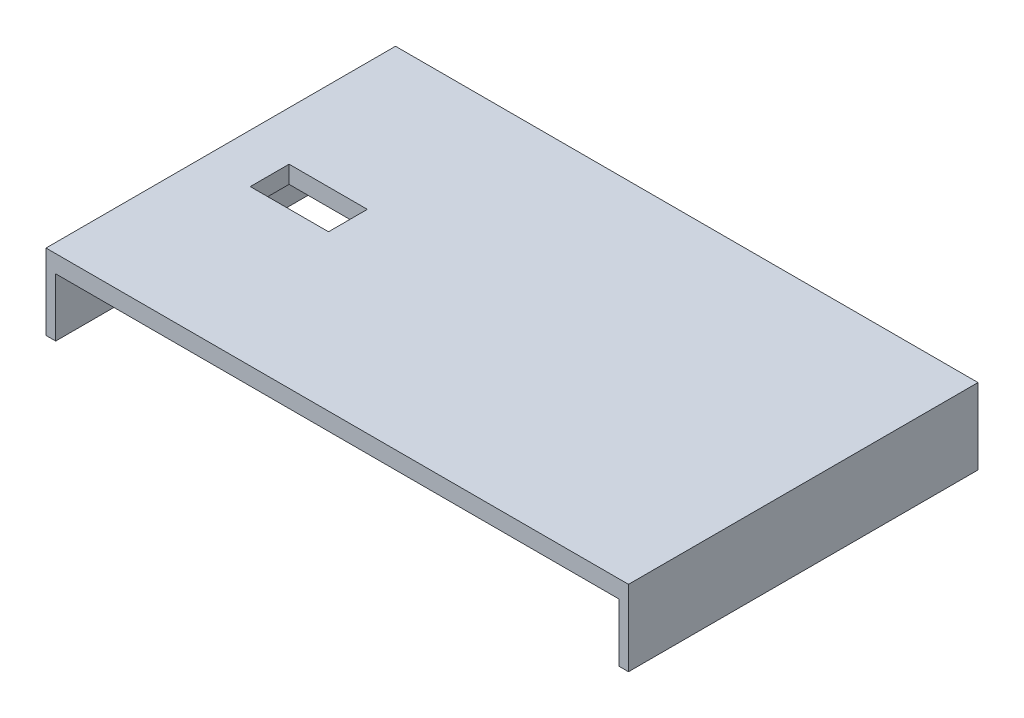
ISO-10303-21;
HEADER;
FILE_DESCRIPTION(('STEP AP214'),'2;1');
FILE_NAME('part.step','',(''),(''),'','','');
FILE_SCHEMA(('AUTOMOTIVE_DESIGN { 1 0 10303 214 1 1 1 1 }'));
ENDSEC;
DATA;
#1=APPLICATION_CONTEXT('core data for automotive mechanical design processes');
#2=APPLICATION_PROTOCOL_DEFINITION('international standard','automotive_design',2000,#1);
#3=PRODUCT_CONTEXT('',#1,'mechanical');
#4=PRODUCT('Part','Part','',(#3));
#5=PRODUCT_RELATED_PRODUCT_CATEGORY('part','',(#4));
#6=PRODUCT_DEFINITION_FORMATION('','',#4);
#7=PRODUCT_DEFINITION_CONTEXT('part definition',#1,'design');
#8=PRODUCT_DEFINITION('design','',#6,#7);
#9=PRODUCT_DEFINITION_SHAPE('','',#8);
#10=(LENGTH_UNIT() NAMED_UNIT(*) SI_UNIT(.MILLI.,.METRE.));
#11=(NAMED_UNIT(*) PLANE_ANGLE_UNIT() SI_UNIT($,.RADIAN.));
#12=(NAMED_UNIT(*) SI_UNIT($,.STERADIAN.) SOLID_ANGLE_UNIT());
#13=UNCERTAINTY_MEASURE_WITH_UNIT(LENGTH_MEASURE(1.E-05),#10,'distance_accuracy_value','');
#14=(GEOMETRIC_REPRESENTATION_CONTEXT(3) GLOBAL_UNCERTAINTY_ASSIGNED_CONTEXT((#13)) GLOBAL_UNIT_ASSIGNED_CONTEXT((#10,
#11,#12)) REPRESENTATION_CONTEXT('',''));
#15=CARTESIAN_POINT('',(0.,0.,0.));
#16=DIRECTION('',(0.,0.,1.));
#17=DIRECTION('',(1.,0.,0.));
#18=AXIS2_PLACEMENT_3D('',#15,#16,#17);
#19=CARTESIAN_POINT('',(0.,0.,0.));
#20=DIRECTION('',(0.,-1.,0.));
#21=DIRECTION('',(0.,0.,-1.));
#22=AXIS2_PLACEMENT_3D('',#19,#20,#21);
#23=PLANE('',#22);
#24=DIRECTION('',(-1.,0.,0.));
#25=VECTOR('',#24,1.);
#26=CARTESIAN_POINT('',(0.,0.,-180.));
#27=LINE('',#26,#25);
#28=CARTESIAN_POINT('',(295.,0.,-180.));
#29=VERTEX_POINT('',#28);
#30=CARTESIAN_POINT('',(5.,0.,-180.));
#31=VERTEX_POINT('',#30);
#32=EDGE_CURVE('E196',#29,#31,#27,.T.);
#33=ORIENTED_EDGE('',*,*,#32,.F.);
#34=DIRECTION('',(0.,0.,-1.));
#35=VECTOR('',#34,1.);
#36=CARTESIAN_POINT('',(295.,0.,0.));
#37=LINE('',#36,#35);
#38=CARTESIAN_POINT('',(295.,0.,0.));
#39=VERTEX_POINT('',#38);
#40=EDGE_CURVE('E137',#39,#29,#37,.T.);
#41=ORIENTED_EDGE('',*,*,#40,.F.);
#42=DIRECTION('',(1.,0.,0.));
#43=VECTOR('',#42,1.);
#44=CARTESIAN_POINT('',(0.,0.,0.));
#45=LINE('',#44,#43);
#46=CARTESIAN_POINT('',(5.,0.,0.));
#47=VERTEX_POINT('',#46);
#48=EDGE_CURVE('E191',#47,#39,#45,.T.);
#49=ORIENTED_EDGE('',*,*,#48,.F.);
#50=DIRECTION('',(0.,0.,1.));
#51=VECTOR('',#50,1.);
#52=CARTESIAN_POINT('',(5.,0.,-180.));
#53=LINE('',#52,#51);
#54=EDGE_CURVE('E172',#31,#47,#53,.T.);
#55=ORIENTED_EDGE('',*,*,#54,.F.);
#56=EDGE_LOOP('',(#33,#41,#49,#55));
#57=FACE_BOUND('',#56,.T.);
#58=DIRECTION('',(0.,0.,-1.));
#59=VECTOR('',#58,1.);
#60=CARTESIAN_POINT('',(65.5,0.,-80.));
#61=LINE('',#60,#59);
#62=CARTESIAN_POINT('',(65.5,0.,-80.));
#63=VERTEX_POINT('',#62);
#64=CARTESIAN_POINT('',(65.5,0.,-100.));
#65=VERTEX_POINT('',#64);
#66=EDGE_CURVE('E129',#63,#65,#61,.T.);
#67=ORIENTED_EDGE('',*,*,#66,.T.);
#68=DIRECTION('',(1.,0.,0.));
#69=VECTOR('',#68,1.);
#70=CARTESIAN_POINT('',(25.2,0.,-100.));
#71=LINE('',#70,#69);
#72=CARTESIAN_POINT('',(25.2,0.,-100.));
#73=VERTEX_POINT('',#72);
#74=EDGE_CURVE('E120',#73,#65,#71,.T.);
#75=ORIENTED_EDGE('',*,*,#74,.F.);
#76=DIRECTION('',(0.,0.,-1.));
#77=VECTOR('',#76,1.);
#78=CARTESIAN_POINT('',(25.2,0.,-80.));
#79=LINE('',#78,#77);
#80=CARTESIAN_POINT('',(25.2,0.,-80.));
#81=VERTEX_POINT('',#80);
#82=EDGE_CURVE('E141',#81,#73,#79,.T.);
#83=ORIENTED_EDGE('',*,*,#82,.F.);
#84=DIRECTION('',(1.,0.,0.));
#85=VECTOR('',#84,1.);
#86=CARTESIAN_POINT('',(25.2,0.,-80.));
#87=LINE('',#86,#85);
#88=EDGE_CURVE('E48',#81,#63,#87,.T.);
#89=ORIENTED_EDGE('',*,*,#88,.T.);
#90=EDGE_LOOP('',(#67,#75,#83,#89));
#91=FACE_BOUND('',#90,.T.);
#92=ADVANCED_FACE('F33',(#57,#91),#23,.T.);
#93=CARTESIAN_POINT('',(0.,9.,0.));
#94=DIRECTION('',(0.,-1.,0.));
#95=DIRECTION('',(0.,0.,-1.));
#96=AXIS2_PLACEMENT_3D('',#93,#94,#95);
#97=PLANE('',#96);
#98=DIRECTION('',(0.,0.,1.));
#99=VECTOR('',#98,1.);
#100=CARTESIAN_POINT('',(0.,9.,0.));
#101=LINE('',#100,#99);
#102=CARTESIAN_POINT('',(0.,9.,-180.));
#103=VERTEX_POINT('',#102);
#104=CARTESIAN_POINT('',(0.,9.,0.));
#105=VERTEX_POINT('',#104);
#106=EDGE_CURVE('E192',#103,#105,#101,.T.);
#107=ORIENTED_EDGE('',*,*,#106,.T.);
#108=DIRECTION('',(1.,0.,0.));
#109=VECTOR('',#108,1.);
#110=CARTESIAN_POINT('',(0.,9.,0.));
#111=LINE('',#110,#109);
#112=CARTESIAN_POINT('',(300.,9.,0.));
#113=VERTEX_POINT('',#112);
#114=EDGE_CURVE('E195',#105,#113,#111,.T.);
#115=ORIENTED_EDGE('',*,*,#114,.T.);
#116=DIRECTION('',(0.,0.,-1.));
#117=VECTOR('',#116,1.);
#118=CARTESIAN_POINT('',(300.,9.,0.));
#119=LINE('',#118,#117);
#120=CARTESIAN_POINT('',(300.,9.,-180.));
#121=VERTEX_POINT('',#120);
#122=EDGE_CURVE('E198',#113,#121,#119,.T.);
#123=ORIENTED_EDGE('',*,*,#122,.T.);
#124=DIRECTION('',(-1.,0.,0.));
#125=VECTOR('',#124,1.);
#126=CARTESIAN_POINT('',(0.,9.,-180.));
#127=LINE('',#126,#125);
#128=EDGE_CURVE('E200',#121,#103,#127,.T.);
#129=ORIENTED_EDGE('',*,*,#128,.T.);
#130=EDGE_LOOP('',(#107,#115,#123,#129));
#131=FACE_BOUND('',#130,.T.);
#132=DIRECTION('',(1.,0.,0.));
#133=VECTOR('',#132,1.);
#134=CARTESIAN_POINT('',(25.2,9.,-100.));
#135=LINE('',#134,#133);
#136=CARTESIAN_POINT('',(25.2,9.,-100.));
#137=VERTEX_POINT('',#136);
#138=CARTESIAN_POINT('',(65.5,9.,-100.));
#139=VERTEX_POINT('',#138);
#140=EDGE_CURVE('E56',#137,#139,#135,.T.);
#141=ORIENTED_EDGE('',*,*,#140,.T.);
#142=DIRECTION('',(0.,0.,-1.));
#143=VECTOR('',#142,1.);
#144=CARTESIAN_POINT('',(65.5,9.,-80.));
#145=LINE('',#144,#143);
#146=CARTESIAN_POINT('',(65.5,9.,-80.));
#147=VERTEX_POINT('',#146);
#148=EDGE_CURVE('E136',#147,#139,#145,.T.);
#149=ORIENTED_EDGE('',*,*,#148,.F.);
#150=DIRECTION('',(1.,0.,0.));
#151=VECTOR('',#150,1.);
#152=CARTESIAN_POINT('',(25.2,9.,-80.));
#153=LINE('',#152,#151);
#154=CARTESIAN_POINT('',(25.2,9.,-80.));
#155=VERTEX_POINT('',#154);
#156=EDGE_CURVE('E147',#155,#147,#153,.T.);
#157=ORIENTED_EDGE('',*,*,#156,.F.);
#158=DIRECTION('',(0.,0.,-1.));
#159=VECTOR('',#158,1.);
#160=CARTESIAN_POINT('',(25.2,9.,-80.));
#161=LINE('',#160,#159);
#162=EDGE_CURVE('E130',#155,#137,#161,.T.);
#163=ORIENTED_EDGE('',*,*,#162,.T.);
#164=EDGE_LOOP('',(#141,#149,#157,#163));
#165=FACE_BOUND('',#164,.T.);
#166=ADVANCED_FACE('F230',(#131,#165),#97,.F.);
#167=CARTESIAN_POINT('',(0.,9.,0.));
#168=DIRECTION('',(1.,0.,0.));
#169=DIRECTION('',(0.,0.,-1.));
#170=AXIS2_PLACEMENT_3D('',#167,#168,#169);
#171=PLANE('',#170);
#172=DIRECTION('',(0.,-1.,0.));
#173=VECTOR('',#172,1.);
#174=CARTESIAN_POINT('',(0.,9.,-180.));
#175=LINE('',#174,#173);
#176=CARTESIAN_POINT('',(0.,-30.,-180.));
#177=VERTEX_POINT('',#176);
#178=EDGE_CURVE('E202',#103,#177,#175,.T.);
#179=ORIENTED_EDGE('',*,*,#178,.T.);
#180=DIRECTION('',(0.,0.,-1.));
#181=VECTOR('',#180,1.);
#182=CARTESIAN_POINT('',(0.,-30.,-180.));
#183=LINE('',#182,#181);
#184=CARTESIAN_POINT('',(0.,-30.,0.));
#185=VERTEX_POINT('',#184);
#186=EDGE_CURVE('E173',#185,#177,#183,.T.);
#187=ORIENTED_EDGE('',*,*,#186,.F.);
#188=DIRECTION('',(0.,-1.,0.));
#189=VECTOR('',#188,1.);
#190=CARTESIAN_POINT('',(0.,9.,0.));
#191=LINE('',#190,#189);
#192=EDGE_CURVE('E11',#105,#185,#191,.T.);
#193=ORIENTED_EDGE('',*,*,#192,.F.);
#194=ORIENTED_EDGE('',*,*,#106,.F.);
#195=EDGE_LOOP('',(#179,#187,#193,#194));
#196=FACE_BOUND('',#195,.T.);
#197=ADVANCED_FACE('F35',(#196),#171,.F.);
#198=CARTESIAN_POINT('',(0.,9.,0.));
#199=DIRECTION('',(0.,0.,-1.));
#200=DIRECTION('',(-1.,0.,0.));
#201=AXIS2_PLACEMENT_3D('',#198,#199,#200);
#202=PLANE('',#201);
#203=ORIENTED_EDGE('',*,*,#192,.T.);
#204=DIRECTION('',(-1.,0.,0.));
#205=VECTOR('',#204,1.);
#206=CARTESIAN_POINT('',(0.,-30.,0.));
#207=LINE('',#206,#205);
#208=CARTESIAN_POINT('',(5.,-30.,0.));
#209=VERTEX_POINT('',#208);
#210=EDGE_CURVE('E180',#209,#185,#207,.T.);
#211=ORIENTED_EDGE('',*,*,#210,.F.);
#212=DIRECTION('',(0.,1.,0.));
#213=VECTOR('',#212,1.);
#214=CARTESIAN_POINT('',(5.,-30.,0.));
#215=LINE('',#214,#213);
#216=EDGE_CURVE('E183',#209,#47,#215,.T.);
#217=ORIENTED_EDGE('',*,*,#216,.T.);
#218=ORIENTED_EDGE('',*,*,#48,.T.);
#219=DIRECTION('',(0.,1.,0.));
#220=VECTOR('',#219,1.);
#221=CARTESIAN_POINT('',(295.,-30.,0.));
#222=LINE('',#221,#220);
#223=CARTESIAN_POINT('',(295.,-30.,0.));
#224=VERTEX_POINT('',#223);
#225=EDGE_CURVE('E170',#224,#39,#222,.T.);
#226=ORIENTED_EDGE('',*,*,#225,.F.);
#227=DIRECTION('',(-1.,0.,0.));
#228=VECTOR('',#227,1.);
#229=CARTESIAN_POINT('',(300.,-30.,0.));
#230=LINE('',#229,#228);
#231=CARTESIAN_POINT('',(300.,-30.,0.));
#232=VERTEX_POINT('',#231);
#233=EDGE_CURVE('E159',#232,#224,#230,.T.);
#234=ORIENTED_EDGE('',*,*,#233,.F.);
#235=DIRECTION('',(0.,-1.,0.));
#236=VECTOR('',#235,1.);
#237=CARTESIAN_POINT('',(300.,9.,0.));
#238=LINE('',#237,#236);
#239=EDGE_CURVE('E41',#113,#232,#238,.T.);
#240=ORIENTED_EDGE('',*,*,#239,.F.);
#241=ORIENTED_EDGE('',*,*,#114,.F.);
#242=EDGE_LOOP('',(#203,#211,#217,#218,#226,#234,#240,#241));
#243=FACE_BOUND('',#242,.T.);
#244=ADVANCED_FACE('F217',(#243),#202,.F.);
#245=CARTESIAN_POINT('',(300.,9.,0.));
#246=DIRECTION('',(-1.,0.,0.));
#247=DIRECTION('',(0.,0.,1.));
#248=AXIS2_PLACEMENT_3D('',#245,#246,#247);
#249=PLANE('',#248);
#250=ORIENTED_EDGE('',*,*,#239,.T.);
#251=DIRECTION('',(0.,0.,1.));
#252=VECTOR('',#251,1.);
#253=CARTESIAN_POINT('',(300.,-30.,0.));
#254=LINE('',#253,#252);
#255=CARTESIAN_POINT('',(300.,-30.,-180.));
#256=VERTEX_POINT('',#255);
#257=EDGE_CURVE('E156',#256,#232,#254,.T.);
#258=ORIENTED_EDGE('',*,*,#257,.F.);
#259=DIRECTION('',(0.,-1.,0.));
#260=VECTOR('',#259,1.);
#261=CARTESIAN_POINT('',(300.,9.,-180.));
#262=LINE('',#261,#260);
#263=EDGE_CURVE('E207',#121,#256,#262,.T.);
#264=ORIENTED_EDGE('',*,*,#263,.F.);
#265=ORIENTED_EDGE('',*,*,#122,.F.);
#266=EDGE_LOOP('',(#250,#258,#264,#265));
#267=FACE_BOUND('',#266,.T.);
#268=ADVANCED_FACE('F213',(#267),#249,.F.);
#269=CARTESIAN_POINT('',(0.,9.,-180.));
#270=DIRECTION('',(0.,0.,1.));
#271=DIRECTION('',(1.,0.,0.));
#272=AXIS2_PLACEMENT_3D('',#269,#270,#271);
#273=PLANE('',#272);
#274=ORIENTED_EDGE('',*,*,#263,.T.);
#275=DIRECTION('',(1.,0.,0.));
#276=VECTOR('',#275,1.);
#277=CARTESIAN_POINT('',(300.,-30.,-180.));
#278=LINE('',#277,#276);
#279=CARTESIAN_POINT('',(295.,-30.,-180.));
#280=VERTEX_POINT('',#279);
#281=EDGE_CURVE('E163',#280,#256,#278,.T.);
#282=ORIENTED_EDGE('',*,*,#281,.F.);
#283=DIRECTION('',(0.,1.,0.));
#284=VECTOR('',#283,1.);
#285=CARTESIAN_POINT('',(295.,-30.,-180.));
#286=LINE('',#285,#284);
#287=EDGE_CURVE('E166',#280,#29,#286,.T.);
#288=ORIENTED_EDGE('',*,*,#287,.T.);
#289=ORIENTED_EDGE('',*,*,#32,.T.);
#290=DIRECTION('',(0.,1.,0.));
#291=VECTOR('',#290,1.);
#292=CARTESIAN_POINT('',(5.,-30.,-180.));
#293=LINE('',#292,#291);
#294=CARTESIAN_POINT('',(5.,-30.,-180.));
#295=VERTEX_POINT('',#294);
#296=EDGE_CURVE('E188',#295,#31,#293,.T.);
#297=ORIENTED_EDGE('',*,*,#296,.F.);
#298=DIRECTION('',(1.,0.,0.));
#299=VECTOR('',#298,1.);
#300=CARTESIAN_POINT('',(0.,-30.,-180.));
#301=LINE('',#300,#299);
#302=EDGE_CURVE('E176',#177,#295,#301,.T.);
#303=ORIENTED_EDGE('',*,*,#302,.F.);
#304=ORIENTED_EDGE('',*,*,#178,.F.);
#305=ORIENTED_EDGE('',*,*,#128,.F.);
#306=EDGE_LOOP('',(#274,#282,#288,#289,#297,#303,#304,#305));
#307=FACE_BOUND('',#306,.T.);
#308=ADVANCED_FACE('F224',(#307),#273,.F.);
#309=CARTESIAN_POINT('',(5.,-30.,-180.));
#310=DIRECTION('',(-1.,0.,0.));
#311=DIRECTION('',(0.,0.,1.));
#312=AXIS2_PLACEMENT_3D('',#309,#310,#311);
#313=PLANE('',#312);
#314=ORIENTED_EDGE('',*,*,#54,.T.);
#315=ORIENTED_EDGE('',*,*,#216,.F.);
#316=DIRECTION('',(0.,0.,1.));
#317=VECTOR('',#316,1.);
#318=CARTESIAN_POINT('',(5.,-30.,-180.));
#319=LINE('',#318,#317);
#320=EDGE_CURVE('E178',#295,#209,#319,.T.);
#321=ORIENTED_EDGE('',*,*,#320,.F.);
#322=ORIENTED_EDGE('',*,*,#296,.T.);
#323=EDGE_LOOP('',(#314,#315,#321,#322));
#324=FACE_BOUND('',#323,.T.);
#325=ADVANCED_FACE('F244',(#324),#313,.F.);
#326=CARTESIAN_POINT('',(0.,-30.,0.));
#327=DIRECTION('',(0.,1.,0.));
#328=DIRECTION('',(0.,0.,1.));
#329=AXIS2_PLACEMENT_3D('',#326,#327,#328);
#330=PLANE('',#329);
#331=ORIENTED_EDGE('',*,*,#186,.T.);
#332=ORIENTED_EDGE('',*,*,#302,.T.);
#333=ORIENTED_EDGE('',*,*,#320,.T.);
#334=ORIENTED_EDGE('',*,*,#210,.T.);
#335=EDGE_LOOP('',(#331,#332,#333,#334));
#336=FACE_BOUND('',#335,.T.);
#337=ADVANCED_FACE('F237',(#336),#330,.F.);
#338=CARTESIAN_POINT('',(295.,-30.,0.));
#339=DIRECTION('',(1.,0.,0.));
#340=DIRECTION('',(0.,0.,-1.));
#341=AXIS2_PLACEMENT_3D('',#338,#339,#340);
#342=PLANE('',#341);
#343=ORIENTED_EDGE('',*,*,#40,.T.);
#344=ORIENTED_EDGE('',*,*,#287,.F.);
#345=DIRECTION('',(0.,0.,-1.));
#346=VECTOR('',#345,1.);
#347=CARTESIAN_POINT('',(295.,-30.,0.));
#348=LINE('',#347,#346);
#349=EDGE_CURVE('E161',#224,#280,#348,.T.);
#350=ORIENTED_EDGE('',*,*,#349,.F.);
#351=ORIENTED_EDGE('',*,*,#225,.T.);
#352=EDGE_LOOP('',(#343,#344,#350,#351));
#353=FACE_BOUND('',#352,.T.);
#354=ADVANCED_FACE('F248',(#353),#342,.F.);
#355=CARTESIAN_POINT('',(0.,-30.,0.));
#356=DIRECTION('',(0.,1.,0.));
#357=DIRECTION('',(0.,0.,1.));
#358=AXIS2_PLACEMENT_3D('',#355,#356,#357);
#359=PLANE('',#358);
#360=ORIENTED_EDGE('',*,*,#257,.T.);
#361=ORIENTED_EDGE('',*,*,#233,.T.);
#362=ORIENTED_EDGE('',*,*,#349,.T.);
#363=ORIENTED_EDGE('',*,*,#281,.T.);
#364=EDGE_LOOP('',(#360,#361,#362,#363));
#365=FACE_BOUND('',#364,.T.);
#366=ADVANCED_FACE('F220',(#365),#359,.F.);
#367=CARTESIAN_POINT('',(25.2,0.,-100.));
#368=DIRECTION('',(0.,0.,1.));
#369=DIRECTION('',(1.,0.,0.));
#370=AXIS2_PLACEMENT_3D('',#367,#368,#369);
#371=PLANE('',#370);
#372=ORIENTED_EDGE('',*,*,#140,.F.);
#373=DIRECTION('',(0.,1.,0.));
#374=VECTOR('',#373,1.);
#375=CARTESIAN_POINT('',(25.2,0.,-100.));
#376=LINE('',#375,#374);
#377=EDGE_CURVE('E125',#73,#137,#376,.T.);
#378=ORIENTED_EDGE('',*,*,#377,.F.);
#379=ORIENTED_EDGE('',*,*,#74,.T.);
#380=DIRECTION('',(0.,1.,0.));
#381=VECTOR('',#380,1.);
#382=CARTESIAN_POINT('',(65.5,0.,-100.));
#383=LINE('',#382,#381);
#384=EDGE_CURVE('E123',#65,#139,#383,.T.);
#385=ORIENTED_EDGE('',*,*,#384,.T.);
#386=EDGE_LOOP('',(#372,#378,#379,#385));
#387=FACE_BOUND('',#386,.T.);
#388=ADVANCED_FACE('F122',(#387),#371,.T.);
#389=CARTESIAN_POINT('',(65.5,0.,-80.));
#390=DIRECTION('',(1.,0.,0.));
#391=DIRECTION('',(0.,0.,-1.));
#392=AXIS2_PLACEMENT_3D('',#389,#390,#391);
#393=PLANE('',#392);
#394=ORIENTED_EDGE('',*,*,#148,.T.);
#395=ORIENTED_EDGE('',*,*,#384,.F.);
#396=ORIENTED_EDGE('',*,*,#66,.F.);
#397=DIRECTION('',(0.,1.,0.));
#398=VECTOR('',#397,1.);
#399=CARTESIAN_POINT('',(65.5,0.,-80.));
#400=LINE('',#399,#398);
#401=EDGE_CURVE('E138',#63,#147,#400,.T.);
#402=ORIENTED_EDGE('',*,*,#401,.T.);
#403=EDGE_LOOP('',(#394,#395,#396,#402));
#404=FACE_BOUND('',#403,.T.);
#405=ADVANCED_FACE('F134',(#404),#393,.F.);
#406=CARTESIAN_POINT('',(25.2,0.,-80.));
#407=DIRECTION('',(0.,0.,1.));
#408=DIRECTION('',(1.,0.,0.));
#409=AXIS2_PLACEMENT_3D('',#406,#407,#408);
#410=PLANE('',#409);
#411=ORIENTED_EDGE('',*,*,#156,.T.);
#412=ORIENTED_EDGE('',*,*,#401,.F.);
#413=ORIENTED_EDGE('',*,*,#88,.F.);
#414=DIRECTION('',(0.,1.,0.));
#415=VECTOR('',#414,1.);
#416=CARTESIAN_POINT('',(25.2,0.,-80.));
#417=LINE('',#416,#415);
#418=EDGE_CURVE('E153',#81,#155,#417,.T.);
#419=ORIENTED_EDGE('',*,*,#418,.T.);
#420=EDGE_LOOP('',(#411,#412,#413,#419));
#421=FACE_BOUND('',#420,.T.);
#422=ADVANCED_FACE('F299',(#421),#410,.F.);
#423=CARTESIAN_POINT('',(25.2,0.,-80.));
#424=DIRECTION('',(1.,0.,0.));
#425=DIRECTION('',(0.,0.,-1.));
#426=AXIS2_PLACEMENT_3D('',#423,#424,#425);
#427=PLANE('',#426);
#428=ORIENTED_EDGE('',*,*,#162,.F.);
#429=ORIENTED_EDGE('',*,*,#418,.F.);
#430=ORIENTED_EDGE('',*,*,#82,.T.);
#431=ORIENTED_EDGE('',*,*,#377,.T.);
#432=EDGE_LOOP('',(#428,#429,#430,#431));
#433=FACE_BOUND('',#432,.T.);
#434=ADVANCED_FACE('F308',(#433),#427,.T.);
#435=CLOSED_SHELL('',(#92,#166,#197,#244,#268,#308,#325,#337,#354,#366,#388,#405,#422,#434));
#436=MANIFOLD_SOLID_BREP('B2',#435);
#437=ADVANCED_BREP_SHAPE_REPRESENTATION('',(#18,#436),#14);
#438=SHAPE_DEFINITION_REPRESENTATION(#9,#437);
ENDSEC;
END-ISO-10303-21;
